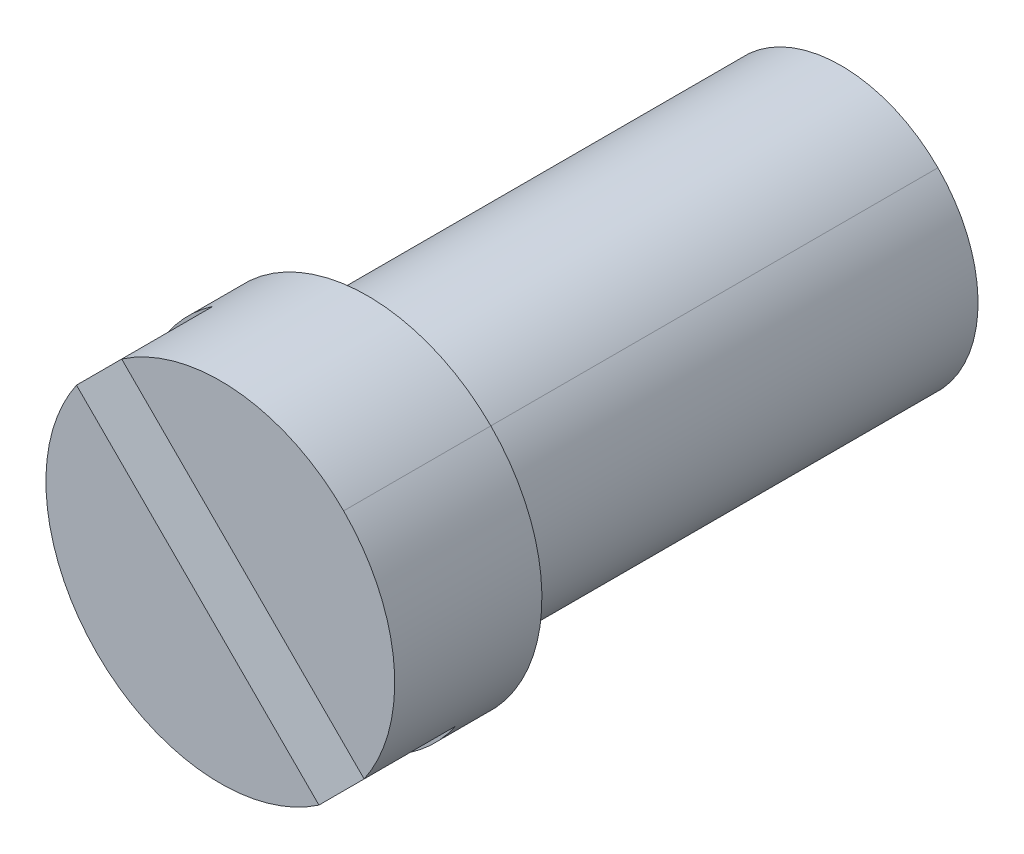
ISO-10303-21;
HEADER;
FILE_DESCRIPTION(('STEP AP214'),'2;1');
FILE_NAME('part.step','',(''),(''),'','','');
FILE_SCHEMA(('AUTOMOTIVE_DESIGN { 1 0 10303 214 1 1 1 1 }'));
ENDSEC;
DATA;
#1=APPLICATION_CONTEXT('core data for automotive mechanical design processes');
#2=APPLICATION_PROTOCOL_DEFINITION('international standard','automotive_design',2000,#1);
#3=PRODUCT_CONTEXT('',#1,'mechanical');
#4=PRODUCT('Part','Part','',(#3));
#5=PRODUCT_RELATED_PRODUCT_CATEGORY('part','',(#4));
#6=PRODUCT_DEFINITION_FORMATION('','',#4);
#7=PRODUCT_DEFINITION_CONTEXT('part definition',#1,'design');
#8=PRODUCT_DEFINITION('design','',#6,#7);
#9=PRODUCT_DEFINITION_SHAPE('','',#8);
#10=(LENGTH_UNIT() NAMED_UNIT(*) SI_UNIT(.MILLI.,.METRE.));
#11=(NAMED_UNIT(*) PLANE_ANGLE_UNIT() SI_UNIT($,.RADIAN.));
#12=(NAMED_UNIT(*) SI_UNIT($,.STERADIAN.) SOLID_ANGLE_UNIT());
#13=UNCERTAINTY_MEASURE_WITH_UNIT(LENGTH_MEASURE(1.E-05),#10,'distance_accuracy_value','');
#14=(GEOMETRIC_REPRESENTATION_CONTEXT(3) GLOBAL_UNCERTAINTY_ASSIGNED_CONTEXT((#13)) GLOBAL_UNIT_ASSIGNED_CONTEXT((#10,
#11,#12)) REPRESENTATION_CONTEXT('',''));
#15=CARTESIAN_POINT('',(0.,0.,0.));
#16=DIRECTION('',(0.,0.,1.));
#17=DIRECTION('',(1.,0.,0.));
#18=AXIS2_PLACEMENT_3D('',#15,#16,#17);
#19=CARTESIAN_POINT('',(2.54034380597097,5.27034380597093,8.76943375672969));
#20=DIRECTION('',(0.,0.,1.));
#21=DIRECTION('',(0.707106781186547,0.707106781186548,0.));
#22=AXIS2_PLACEMENT_3D('',#19,#20,#21);
#23=CYLINDRICAL_SURFACE('',#22,1.5);
#24=DIRECTION('',(0.,0.,-1.));
#25=VECTOR('',#24,1.);
#26=CARTESIAN_POINT('',(3.6010039777508,6.33100397775075,8.76943375672969));
#27=LINE('',#26,#25);
#28=CARTESIAN_POINT('',(3.6010039777508,6.33100397775075,12.0176388374866));
#29=VERTEX_POINT('',#28);
#30=CARTESIAN_POINT('',(3.6010039777508,6.33100397775075,6.83));
#31=VERTEX_POINT('',#30);
#32=EDGE_CURVE('E28',#29,#31,#27,.T.);
#33=ORIENTED_EDGE('',*,*,#32,.F.);
#34=CARTESIAN_POINT('',(2.54034380597097,5.27034380597093,12.0176388374866));
#35=DIRECTION('',(0.,0.,-1.));
#36=DIRECTION('',(0.707106781186547,0.707106781186548,0.));
#37=AXIS2_PLACEMENT_3D('',#34,#35,#36);
#38=CIRCLE('',#37,1.5);
#39=CARTESIAN_POINT('',(1.47968363419116,4.20968363419111,12.0176388374866));
#40=VERTEX_POINT('',#39);
#41=EDGE_CURVE('E112',#29,#40,#38,.T.);
#42=ORIENTED_EDGE('',*,*,#41,.T.);
#43=DIRECTION('',(0.,0.,-1.));
#44=VECTOR('',#43,1.);
#45=CARTESIAN_POINT('',(1.47968363419116,4.20968363419111,8.76943375672969));
#46=LINE('',#45,#44);
#47=CARTESIAN_POINT('',(1.47968363419116,4.20968363419111,6.83));
#48=VERTEX_POINT('',#47);
#49=EDGE_CURVE('E101',#40,#48,#46,.T.);
#50=ORIENTED_EDGE('',*,*,#49,.T.);
#51=CARTESIAN_POINT('',(2.54034380597097,5.27034380597093,6.83));
#52=DIRECTION('',(0.,0.,-1.));
#53=DIRECTION('',(0.707106781186547,0.707106781186548,0.));
#54=AXIS2_PLACEMENT_3D('',#51,#52,#53);
#55=CIRCLE('',#54,1.5);
#56=EDGE_CURVE('E139',#31,#48,#55,.T.);
#57=ORIENTED_EDGE('',*,*,#56,.F.);
#58=EDGE_LOOP('',(#33,#42,#50,#57));
#59=FACE_BOUND('',#58,.T.);
#60=ADVANCED_FACE('F17',(#59),#23,.T.);
#61=CARTESIAN_POINT('',(2.54034380597097,5.27034380597093,12.8238194187433));
#62=DIRECTION('',(0.,0.,-1.));
#63=DIRECTION('',(0.707106781186545,0.70710678118655,0.));
#64=AXIS2_PLACEMENT_3D('',#61,#62,#63);
#65=CYLINDRICAL_SURFACE('',#64,1.91034380597093);
#66=DIRECTION('',(0.,0.,1.));
#67=VECTOR('',#66,1.);
#68=CARTESIAN_POINT('',(1.18952674637124,3.91952674637119,12.8238194187433));
#69=LINE('',#68,#67);
#70=CARTESIAN_POINT('',(1.18952674637124,3.91952674637119,12.0176388374866));
#71=VERTEX_POINT('',#70);
#72=CARTESIAN_POINT('',(1.18952674637124,3.91952674637119,13.63));
#73=VERTEX_POINT('',#72);
#74=EDGE_CURVE('E127',#71,#73,#69,.T.);
#75=ORIENTED_EDGE('',*,*,#74,.T.);
#76=CARTESIAN_POINT('',(2.54034380597097,5.27034380597093,13.63));
#77=DIRECTION('',(0.,0.,1.));
#78=DIRECTION('',(0.707106781186545,0.70710678118655,0.));
#79=AXIS2_PLACEMENT_3D('',#76,#77,#78);
#80=CIRCLE('',#79,1.91034380597093);
#81=CARTESIAN_POINT('',(0.964904351904491,6.35080851320685,13.63));
#82=VERTEX_POINT('',#81);
#83=EDGE_CURVE('E115',#82,#73,#80,.T.);
#84=ORIENTED_EDGE('',*,*,#83,.F.);
#85=DIRECTION('',(0.,0.,1.));
#86=VECTOR('',#85,1.);
#87=CARTESIAN_POINT('',(0.964904351904491,6.35080851320685,12.8238194187433));
#88=LINE('',#87,#86);
#89=CARTESIAN_POINT('',(0.964904351904491,6.35080851320685,12.63));
#90=VERTEX_POINT('',#89);
#91=EDGE_CURVE('E130',#90,#82,#88,.T.);
#92=ORIENTED_EDGE('',*,*,#91,.F.);
#93=CARTESIAN_POINT('',(2.54034380597097,5.27034380597093,12.63));
#94=DIRECTION('',(0.,0.,1.));
#95=DIRECTION('',(0.707106781186545,0.70710678118655,0.));
#96=AXIS2_PLACEMENT_3D('',#93,#94,#95);
#97=CIRCLE('',#96,1.91034380597093);
#98=CARTESIAN_POINT('',(1.45987909873507,6.84578326003743,12.63));
#99=VERTEX_POINT('',#98);
#100=EDGE_CURVE('E81',#99,#90,#97,.T.);
#101=ORIENTED_EDGE('',*,*,#100,.F.);
#102=DIRECTION('',(0.,0.,1.));
#103=VECTOR('',#102,1.);
#104=CARTESIAN_POINT('',(1.45987909873507,6.84578326003743,12.8238194187433));
#105=LINE('',#104,#103);
#106=CARTESIAN_POINT('',(1.45987909873507,6.84578326003743,13.63));
#107=VERTEX_POINT('',#106);
#108=EDGE_CURVE('E21',#99,#107,#105,.T.);
#109=ORIENTED_EDGE('',*,*,#108,.T.);
#110=CARTESIAN_POINT('',(2.54034380597097,5.27034380597093,13.63));
#111=DIRECTION('',(0.,0.,1.));
#112=DIRECTION('',(0.707106781186545,0.70710678118655,0.));
#113=AXIS2_PLACEMENT_3D('',#110,#111,#112);
#114=CIRCLE('',#113,1.91034380597093);
#115=CARTESIAN_POINT('',(3.89116086557072,6.62116086557068,13.63));
#116=VERTEX_POINT('',#115);
#117=EDGE_CURVE('E11',#116,#107,#114,.T.);
#118=ORIENTED_EDGE('',*,*,#117,.F.);
#119=DIRECTION('',(0.,0.,1.));
#120=VECTOR('',#119,1.);
#121=CARTESIAN_POINT('',(3.89116086557072,6.62116086557068,12.8238194187433));
#122=LINE('',#121,#120);
#123=CARTESIAN_POINT('',(3.89116086557072,6.62116086557068,12.0176388374866));
#124=VERTEX_POINT('',#123);
#125=EDGE_CURVE('E148',#124,#116,#122,.T.);
#126=ORIENTED_EDGE('',*,*,#125,.F.);
#127=CARTESIAN_POINT('',(2.54034380597097,5.27034380597093,12.0176388374866));
#128=DIRECTION('',(0.,0.,-1.));
#129=DIRECTION('',(0.70710678118655,-0.707106781186545,0.));
#130=AXIS2_PLACEMENT_3D('',#127,#128,#129);
#131=CIRCLE('',#130,1.91034380597093);
#132=EDGE_CURVE('E120',#71,#124,#131,.T.);
#133=ORIENTED_EDGE('',*,*,#132,.F.);
#134=EDGE_LOOP('',(#75,#84,#92,#101,#109,#118,#126,#133));
#135=FACE_BOUND('',#134,.T.);
#136=ADVANCED_FACE('F199',(#135),#65,.T.);
#137=CARTESIAN_POINT('',(3.6422202938885,4.16846731805341,13.63));
#138=DIRECTION('',(0.,0.,-1.));
#139=DIRECTION('',(0.,-1.,0.));
#140=AXIS2_PLACEMENT_3D('',#137,#138,#139);
#141=PLANE('',#140);
#142=DIRECTION('',(-0.707106781186548,0.707106781186547,0.));
#143=VECTOR('',#142,1.);
#144=CARTESIAN_POINT('',(2.78783117938627,5.51783117938623,13.63));
#145=LINE('',#144,#143);
#146=CARTESIAN_POINT('',(4.1157832600374,4.1898790987351,13.63));
#147=VERTEX_POINT('',#146);
#148=EDGE_CURVE('E173',#147,#107,#145,.T.);
#149=ORIENTED_EDGE('',*,*,#148,.F.);
#150=CARTESIAN_POINT('',(2.54034380597097,5.27034380597093,13.63));
#151=DIRECTION('',(0.,0.,1.));
#152=DIRECTION('',(0.707106781186545,0.70710678118655,0.));
#153=AXIS2_PLACEMENT_3D('',#150,#151,#152);
#154=CIRCLE('',#153,1.91034380597093);
#155=EDGE_CURVE('E152',#147,#116,#154,.T.);
#156=ORIENTED_EDGE('',*,*,#155,.T.);
#157=ORIENTED_EDGE('',*,*,#117,.T.);
#158=EDGE_LOOP('',(#149,#156,#157));
#159=FACE_BOUND('',#158,.T.);
#160=ADVANCED_FACE('F206',(#159),#141,.F.);
#161=CARTESIAN_POINT('',(2.54034380597097,5.27034380597093,8.76943375672969));
#162=DIRECTION('',(0.,0.,1.));
#163=DIRECTION('',(0.707106781186547,0.707106781186548,0.));
#164=AXIS2_PLACEMENT_3D('',#161,#162,#163);
#165=CYLINDRICAL_SURFACE('',#164,1.5);
#166=CARTESIAN_POINT('',(2.54034380597097,5.27034380597093,6.83));
#167=DIRECTION('',(0.,0.,-1.));
#168=DIRECTION('',(0.707106781186547,0.707106781186548,0.));
#169=AXIS2_PLACEMENT_3D('',#166,#167,#168);
#170=CIRCLE('',#169,1.5);
#171=EDGE_CURVE('E106',#48,#31,#170,.T.);
#172=ORIENTED_EDGE('',*,*,#171,.F.);
#173=ORIENTED_EDGE('',*,*,#49,.F.);
#174=CARTESIAN_POINT('',(2.54034380597097,5.27034380597093,12.0176388374866));
#175=DIRECTION('',(0.,0.,-1.));
#176=DIRECTION('',(0.707106781186547,0.707106781186548,0.));
#177=AXIS2_PLACEMENT_3D('',#174,#175,#176);
#178=CIRCLE('',#177,1.5);
#179=EDGE_CURVE('E104',#40,#29,#178,.T.);
#180=ORIENTED_EDGE('',*,*,#179,.T.);
#181=ORIENTED_EDGE('',*,*,#32,.T.);
#182=EDGE_LOOP('',(#172,#173,#180,#181));
#183=FACE_BOUND('',#182,.T.);
#184=ADVANCED_FACE('F19',(#183),#165,.T.);
#185=CARTESIAN_POINT('',(1.17562602122467,7.13003633754783,12.63));
#186=DIRECTION('',(0.,0.,-1.));
#187=DIRECTION('',(0.,-1.,0.));
#188=AXIS2_PLACEMENT_3D('',#185,#186,#187);
#189=PLANE('',#188);
#190=DIRECTION('',(-0.707106781186548,0.707106781186547,0.));
#191=VECTOR('',#190,1.);
#192=CARTESIAN_POINT('',(2.78783117938627,5.51783117938623,12.63));
#193=LINE('',#192,#191);
#194=CARTESIAN_POINT('',(4.1157832600374,4.1898790987351,12.63));
#195=VERTEX_POINT('',#194);
#196=EDGE_CURVE('E133',#195,#99,#193,.T.);
#197=ORIENTED_EDGE('',*,*,#196,.T.);
#198=ORIENTED_EDGE('',*,*,#100,.T.);
#199=DIRECTION('',(0.707106781186548,-0.707106781186547,0.));
#200=VECTOR('',#199,1.);
#201=CARTESIAN_POINT('',(2.29285643255569,5.02285643255565,12.63));
#202=LINE('',#201,#200);
#203=CARTESIAN_POINT('',(3.62080851320682,3.69490435190452,12.63));
#204=VERTEX_POINT('',#203);
#205=EDGE_CURVE('E183',#90,#204,#202,.T.);
#206=ORIENTED_EDGE('',*,*,#205,.T.);
#207=CARTESIAN_POINT('',(2.54034380597097,5.27034380597093,12.63));
#208=DIRECTION('',(0.,0.,1.));
#209=DIRECTION('',(0.707106781186545,0.70710678118655,0.));
#210=AXIS2_PLACEMENT_3D('',#207,#208,#209);
#211=CIRCLE('',#210,1.91034380597093);
#212=EDGE_CURVE('E68',#204,#195,#211,.T.);
#213=ORIENTED_EDGE('',*,*,#212,.T.);
#214=EDGE_LOOP('',(#197,#198,#206,#213));
#215=FACE_BOUND('',#214,.T.);
#216=ADVANCED_FACE('F264',(#215),#189,.F.);
#217=CARTESIAN_POINT('',(2.14259624155355,4.8725962415535,6.83));
#218=DIRECTION('',(0.,0.,1.));
#219=DIRECTION('',(0.,-1.,0.));
#220=AXIS2_PLACEMENT_3D('',#217,#218,#219);
#221=PLANE('',#220);
#222=ORIENTED_EDGE('',*,*,#171,.T.);
#223=ORIENTED_EDGE('',*,*,#56,.T.);
#224=EDGE_LOOP('',(#222,#223));
#225=FACE_BOUND('',#224,.T.);
#226=ADVANCED_FACE('F293',(#225),#221,.F.);
#227=CARTESIAN_POINT('',(3.6422202938885,4.16846731805341,13.63));
#228=DIRECTION('',(0.,0.,-1.));
#229=DIRECTION('',(0.,-1.,0.));
#230=AXIS2_PLACEMENT_3D('',#227,#228,#229);
#231=PLANE('',#230);
#232=CARTESIAN_POINT('',(2.54034380597097,5.27034380597093,13.63));
#233=DIRECTION('',(0.,0.,1.));
#234=DIRECTION('',(0.707106781186545,0.70710678118655,0.));
#235=AXIS2_PLACEMENT_3D('',#232,#233,#234);
#236=CIRCLE('',#235,1.91034380597093);
#237=CARTESIAN_POINT('',(3.62080851320682,3.69490435190452,13.63));
#238=VERTEX_POINT('',#237);
#239=EDGE_CURVE('E142',#73,#238,#236,.T.);
#240=ORIENTED_EDGE('',*,*,#239,.T.);
#241=DIRECTION('',(0.707106781186548,-0.707106781186547,0.));
#242=VECTOR('',#241,1.);
#243=CARTESIAN_POINT('',(2.29285643255569,5.02285643255565,13.63));
#244=LINE('',#243,#242);
#245=EDGE_CURVE('E154',#82,#238,#244,.T.);
#246=ORIENTED_EDGE('',*,*,#245,.F.);
#247=ORIENTED_EDGE('',*,*,#83,.T.);
#248=EDGE_LOOP('',(#240,#246,#247));
#249=FACE_BOUND('',#248,.T.);
#250=ADVANCED_FACE('F271',(#249),#231,.F.);
#251=CARTESIAN_POINT('',(3.70558514939705,4.10510246254486,12.0176388374866));
#252=DIRECTION('',(0.,0.,1.));
#253=DIRECTION('',(0.,-1.,0.));
#254=AXIS2_PLACEMENT_3D('',#251,#252,#253);
#255=PLANE('',#254);
#256=ORIENTED_EDGE('',*,*,#179,.F.);
#257=ORIENTED_EDGE('',*,*,#41,.F.);
#258=EDGE_LOOP('',(#256,#257));
#259=FACE_BOUND('',#258,.T.);
#260=CARTESIAN_POINT('',(2.54034380597097,5.27034380597093,12.0176388374866));
#261=DIRECTION('',(0.,0.,-1.));
#262=DIRECTION('',(0.70710678118655,-0.707106781186545,0.));
#263=AXIS2_PLACEMENT_3D('',#260,#261,#262);
#264=CIRCLE('',#263,1.91034380597093);
#265=EDGE_CURVE('E153',#124,#71,#264,.T.);
#266=ORIENTED_EDGE('',*,*,#265,.T.);
#267=ORIENTED_EDGE('',*,*,#132,.T.);
#268=EDGE_LOOP('',(#266,#267));
#269=FACE_BOUND('',#268,.T.);
#270=ADVANCED_FACE('F117',(#259,#269),#255,.F.);
#271=CARTESIAN_POINT('',(2.54034380597097,5.27034380597093,12.8238194187433));
#272=DIRECTION('',(0.,0.,-1.));
#273=DIRECTION('',(0.707106781186545,0.70710678118655,0.));
#274=AXIS2_PLACEMENT_3D('',#271,#272,#273);
#275=CYLINDRICAL_SURFACE('',#274,1.91034380597093);
#276=ORIENTED_EDGE('',*,*,#265,.F.);
#277=ORIENTED_EDGE('',*,*,#125,.T.);
#278=ORIENTED_EDGE('',*,*,#155,.F.);
#279=DIRECTION('',(0.,0.,1.));
#280=VECTOR('',#279,1.);
#281=CARTESIAN_POINT('',(4.1157832600374,4.1898790987351,12.8238194187433));
#282=LINE('',#281,#280);
#283=EDGE_CURVE('E136',#195,#147,#282,.T.);
#284=ORIENTED_EDGE('',*,*,#283,.F.);
#285=ORIENTED_EDGE('',*,*,#212,.F.);
#286=DIRECTION('',(0.,0.,1.));
#287=VECTOR('',#286,1.);
#288=CARTESIAN_POINT('',(3.62080851320682,3.69490435190452,12.8238194187433));
#289=LINE('',#288,#287);
#290=EDGE_CURVE('E157',#204,#238,#289,.T.);
#291=ORIENTED_EDGE('',*,*,#290,.T.);
#292=ORIENTED_EDGE('',*,*,#239,.F.);
#293=ORIENTED_EDGE('',*,*,#74,.F.);
#294=EDGE_LOOP('',(#276,#277,#278,#284,#285,#291,#292,#293));
#295=FACE_BOUND('',#294,.T.);
#296=ADVANCED_FACE('F192',(#295),#275,.T.);
#297=CARTESIAN_POINT('',(0.680651274394085,6.63506159071725,12.63));
#298=DIRECTION('',(-0.707106781186547,-0.707106781186548,0.));
#299=DIRECTION('',(-0.707106781186548,0.707106781186547,0.));
#300=AXIS2_PLACEMENT_3D('',#297,#298,#299);
#301=PLANE('',#300);
#302=ORIENTED_EDGE('',*,*,#205,.F.);
#303=ORIENTED_EDGE('',*,*,#91,.T.);
#304=ORIENTED_EDGE('',*,*,#245,.T.);
#305=ORIENTED_EDGE('',*,*,#290,.F.);
#306=EDGE_LOOP('',(#302,#303,#304,#305));
#307=FACE_BOUND('',#306,.T.);
#308=ADVANCED_FACE('F278',(#307),#301,.F.);
#309=CARTESIAN_POINT('',(1.17562602122467,7.13003633754783,14.515608753973));
#310=DIRECTION('',(0.707106781186547,0.707106781186548,0.));
#311=DIRECTION('',(0.,0.,-1.));
#312=AXIS2_PLACEMENT_3D('',#309,#310,#311);
#313=PLANE('',#312);
#314=ORIENTED_EDGE('',*,*,#148,.T.);
#315=ORIENTED_EDGE('',*,*,#108,.F.);
#316=ORIENTED_EDGE('',*,*,#196,.F.);
#317=ORIENTED_EDGE('',*,*,#283,.T.);
#318=EDGE_LOOP('',(#314,#315,#316,#317));
#319=FACE_BOUND('',#318,.T.);
#320=ADVANCED_FACE('F217',(#319),#313,.F.);
#321=CLOSED_SHELL('',(#60,#136,#160,#184,#216,#226,#250,#270,#296,#308,#320));
#322=MANIFOLD_SOLID_BREP('B1',#321);
#323=ADVANCED_BREP_SHAPE_REPRESENTATION('',(#18,#322),#14);
#324=SHAPE_DEFINITION_REPRESENTATION(#9,#323);
ENDSEC;
END-ISO-10303-21;
